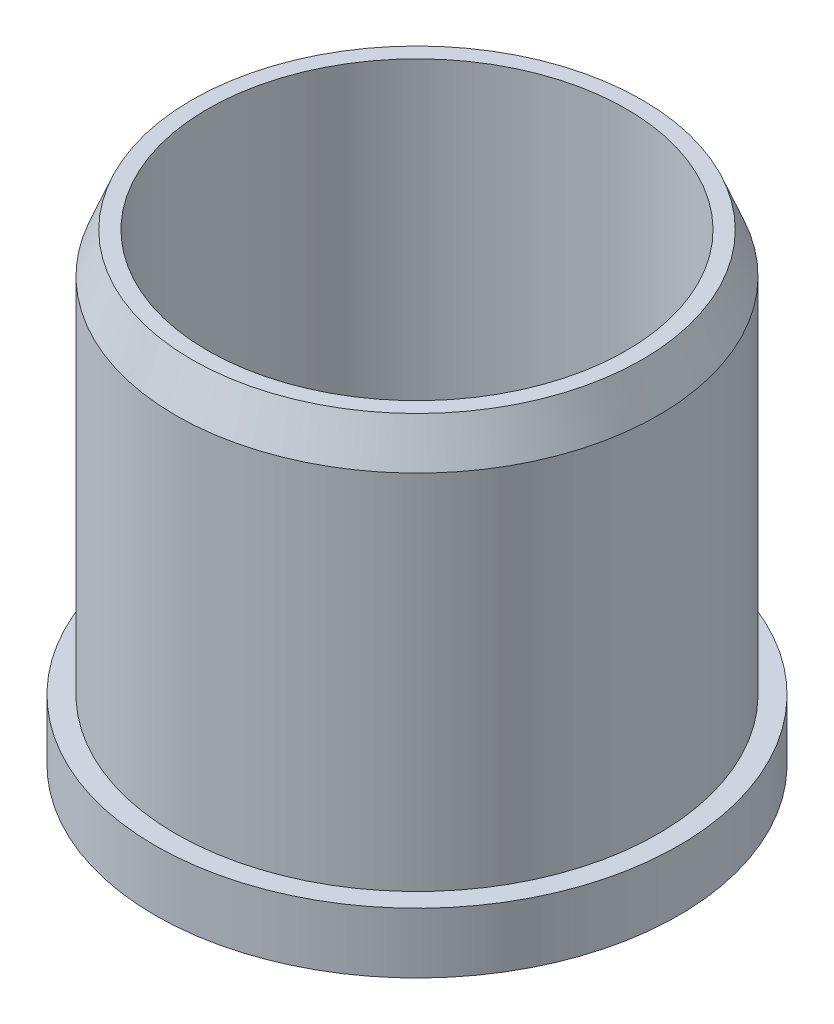
ISO-10303-21;
HEADER;
FILE_DESCRIPTION(('STEP AP214'),'2;1');
FILE_NAME('part.step','',(''),(''),'','','');
FILE_SCHEMA(('AUTOMOTIVE_DESIGN { 1 0 10303 214 1 1 1 1 }'));
ENDSEC;
DATA;
#1=APPLICATION_CONTEXT('core data for automotive mechanical design processes');
#2=APPLICATION_PROTOCOL_DEFINITION('international standard','automotive_design',2000,#1);
#3=PRODUCT_CONTEXT('',#1,'mechanical');
#4=PRODUCT('Part','Part','',(#3));
#5=PRODUCT_RELATED_PRODUCT_CATEGORY('part','',(#4));
#6=PRODUCT_DEFINITION_FORMATION('','',#4);
#7=PRODUCT_DEFINITION_CONTEXT('part definition',#1,'design');
#8=PRODUCT_DEFINITION('design','',#6,#7);
#9=PRODUCT_DEFINITION_SHAPE('','',#8);
#10=(LENGTH_UNIT() NAMED_UNIT(*) SI_UNIT(.MILLI.,.METRE.));
#11=(NAMED_UNIT(*) PLANE_ANGLE_UNIT() SI_UNIT($,.RADIAN.));
#12=(NAMED_UNIT(*) SI_UNIT($,.STERADIAN.) SOLID_ANGLE_UNIT());
#13=UNCERTAINTY_MEASURE_WITH_UNIT(LENGTH_MEASURE(1.E-05),#10,'distance_accuracy_value','');
#14=(GEOMETRIC_REPRESENTATION_CONTEXT(3) GLOBAL_UNCERTAINTY_ASSIGNED_CONTEXT((#13)) GLOBAL_UNIT_ASSIGNED_CONTEXT((#10,
#11,#12)) REPRESENTATION_CONTEXT('',''));
#15=CARTESIAN_POINT('',(0.,0.,0.));
#16=DIRECTION('',(0.,0.,1.));
#17=DIRECTION('',(1.,0.,0.));
#18=AXIS2_PLACEMENT_3D('',#15,#16,#17);
#19=CARTESIAN_POINT('',(0.,9.525,0.));
#20=DIRECTION('',(0.,1.,0.));
#21=DIRECTION('',(0.,0.,1.));
#22=AXIS2_PLACEMENT_3D('',#19,#20,#21);
#23=PLANE('',#22);
#24=CARTESIAN_POINT('',(0.,9.525,0.));
#25=DIRECTION('',(0.,1.,0.));
#26=DIRECTION('',(0.,0.,1.));
#27=AXIS2_PLACEMENT_3D('',#24,#25,#26);
#28=CIRCLE('',#27,12.7);
#29=CARTESIAN_POINT('',(0.,9.525,12.7));
#30=VERTEX_POINT('',#29);
#31=EDGE_CURVE('E87',#30,#30,#28,.T.);
#32=ORIENTED_EDGE('',*,*,#31,.F.);
#33=EDGE_LOOP('',(#32));
#34=FACE_BOUND('',#33,.T.);
#35=CARTESIAN_POINT('',(21.7411519625083,9.525,-7.06412849141284));
#36=DIRECTION('',(0.,1.,0.));
#37=DIRECTION('',(0.,0.,1.));
#38=AXIS2_PLACEMENT_3D('',#35,#36,#37);
#39=CIRCLE('',#38,7.62);
#40=CARTESIAN_POINT('',(21.7411519625083,9.525,0.555871508587157));
#41=VERTEX_POINT('',#40);
#42=EDGE_CURVE('E133',#41,#41,#39,.T.);
#43=ORIENTED_EDGE('',*,*,#42,.F.);
#44=EDGE_LOOP('',(#43));
#45=FACE_BOUND('',#44,.T.);
#46=CARTESIAN_POINT('',(13.4367708674089,9.525,18.4941284914103));
#47=DIRECTION('',(0.,1.,0.));
#48=DIRECTION('',(0.,0.,1.));
#49=AXIS2_PLACEMENT_3D('',#46,#47,#48);
#50=CIRCLE('',#49,7.62);
#51=CARTESIAN_POINT('',(13.4367708674089,9.525,26.1141284914103));
#52=VERTEX_POINT('',#51);
#53=EDGE_CURVE('E130',#52,#52,#50,.T.);
#54=ORIENTED_EDGE('',*,*,#53,.F.);
#55=EDGE_LOOP('',(#54));
#56=FACE_BOUND('',#55,.T.);
#57=CARTESIAN_POINT('',(-13.436770867403,9.525,18.4941284914123));
#58=DIRECTION('',(0.,1.,0.));
#59=DIRECTION('',(0.,0.,1.));
#60=AXIS2_PLACEMENT_3D('',#57,#58,#59);
#61=CIRCLE('',#60,7.62);
#62=CARTESIAN_POINT('',(-13.436770867403,9.525,26.1141284914122));
#63=VERTEX_POINT('',#62);
#64=EDGE_CURVE('E127',#63,#63,#61,.T.);
#65=ORIENTED_EDGE('',*,*,#64,.F.);
#66=EDGE_LOOP('',(#65));
#67=FACE_BOUND('',#66,.T.);
#68=CARTESIAN_POINT('',(-21.7411519625061,9.525,-7.06412849140975));
#69=DIRECTION('',(0.,1.,0.));
#70=DIRECTION('',(0.,0.,1.));
#71=AXIS2_PLACEMENT_3D('',#68,#69,#70);
#72=CIRCLE('',#71,7.62);
#73=CARTESIAN_POINT('',(-21.7411519625061,9.525,0.555871508590244));
#74=VERTEX_POINT('',#73);
#75=EDGE_CURVE('E123',#74,#74,#72,.T.);
#76=ORIENTED_EDGE('',*,*,#75,.F.);
#77=EDGE_LOOP('',(#76));
#78=FACE_BOUND('',#77,.T.);
#79=CARTESIAN_POINT('',(0.,9.525,-22.86));
#80=DIRECTION('',(0.,1.,0.));
#81=DIRECTION('',(0.,0.,1.));
#82=AXIS2_PLACEMENT_3D('',#79,#80,#81);
#83=CIRCLE('',#82,7.62);
#84=CARTESIAN_POINT('',(0.,9.525,-15.24));
#85=VERTEX_POINT('',#84);
#86=EDGE_CURVE('E120',#85,#85,#83,.T.);
#87=ORIENTED_EDGE('',*,*,#86,.F.);
#88=EDGE_LOOP('',(#87));
#89=FACE_BOUND('',#88,.T.);
#90=CARTESIAN_POINT('',(0.,9.525,0.));
#91=DIRECTION('',(0.,1.,0.));
#92=DIRECTION('',(0.,0.,1.));
#93=AXIS2_PLACEMENT_3D('',#90,#91,#92);
#94=CIRCLE('',#93,33.02);
#95=CARTESIAN_POINT('',(0.,9.525,33.02));
#96=VERTEX_POINT('',#95);
#97=EDGE_CURVE('E102',#96,#96,#94,.T.);
#98=ORIENTED_EDGE('',*,*,#97,.T.);
#99=EDGE_LOOP('',(#98));
#100=FACE_BOUND('',#99,.T.);
#101=ADVANCED_FACE('F41',(#34,#45,#56,#67,#78,#89,#100),#23,.T.);
#102=CARTESIAN_POINT('',(0.,9.525,0.));
#103=DIRECTION('',(0.,-1.,0.));
#104=DIRECTION('',(0.,0.,-1.));
#105=AXIS2_PLACEMENT_3D('',#102,#103,#104);
#106=CYLINDRICAL_SURFACE('',#105,7.1);
#107=CARTESIAN_POINT('',(0.,0.,0.));
#108=DIRECTION('',(0.,1.,0.));
#109=DIRECTION('',(0.,0.,1.));
#110=AXIS2_PLACEMENT_3D('',#107,#108,#109);
#111=CIRCLE('',#110,7.1);
#112=CARTESIAN_POINT('',(6.64529909033446,0.,-2.5));
#113=VERTEX_POINT('',#112);
#114=CARTESIAN_POINT('',(6.64529909033446,0.,2.5));
#115=VERTEX_POINT('',#114);
#116=EDGE_CURVE('E156',#113,#115,#111,.T.);
#117=ORIENTED_EDGE('',*,*,#116,.F.);
#118=DIRECTION('',(0.,-1.,0.));
#119=VECTOR('',#118,1.);
#120=CARTESIAN_POINT('',(6.64529909033446,9.525,-2.5));
#121=LINE('',#120,#119);
#122=CARTESIAN_POINT('',(6.64529909033446,25.4,-2.5));
#123=VERTEX_POINT('',#122);
#124=EDGE_CURVE('E119',#123,#113,#121,.T.);
#125=ORIENTED_EDGE('',*,*,#124,.F.);
#126=CARTESIAN_POINT('',(0.,25.4,0.));
#127=DIRECTION('',(0.,1.,0.));
#128=DIRECTION('',(0.,0.,1.));
#129=AXIS2_PLACEMENT_3D('',#126,#127,#128);
#130=CIRCLE('',#129,7.1);
#131=CARTESIAN_POINT('',(6.64529909033446,25.4,2.5));
#132=VERTEX_POINT('',#131);
#133=EDGE_CURVE('E86',#132,#123,#130,.F.);
#134=ORIENTED_EDGE('',*,*,#133,.F.);
#135=DIRECTION('',(0.,-1.,0.));
#136=VECTOR('',#135,1.);
#137=CARTESIAN_POINT('',(6.64529909033446,9.525,2.5));
#138=LINE('',#137,#136);
#139=EDGE_CURVE('E56',#132,#115,#138,.T.);
#140=ORIENTED_EDGE('',*,*,#139,.T.);
#141=EDGE_LOOP('',(#117,#125,#134,#140));
#142=FACE_BOUND('',#141,.T.);
#143=ADVANCED_FACE('F184',(#142),#106,.F.);
#144=CARTESIAN_POINT('',(0.,9.525,-2.5));
#145=DIRECTION('',(0.,0.,1.));
#146=DIRECTION('',(1.,0.,0.));
#147=AXIS2_PLACEMENT_3D('',#144,#145,#146);
#148=PLANE('',#147);
#149=DIRECTION('',(-1.,0.,0.));
#150=VECTOR('',#149,1.);
#151=CARTESIAN_POINT('',(0.,0.,-2.5));
#152=LINE('',#151,#150);
#153=CARTESIAN_POINT('',(9.6,0.,-2.5));
#154=VERTEX_POINT('',#153);
#155=EDGE_CURVE('E159',#154,#113,#152,.T.);
#156=ORIENTED_EDGE('',*,*,#155,.F.);
#157=DIRECTION('',(0.,-1.,0.));
#158=VECTOR('',#157,1.);
#159=CARTESIAN_POINT('',(9.6,9.525,-2.5));
#160=LINE('',#159,#158);
#161=CARTESIAN_POINT('',(9.6,25.4,-2.5));
#162=VERTEX_POINT('',#161);
#163=EDGE_CURVE('E97',#162,#154,#160,.T.);
#164=ORIENTED_EDGE('',*,*,#163,.F.);
#165=DIRECTION('',(1.,0.,0.));
#166=VECTOR('',#165,1.);
#167=CARTESIAN_POINT('',(0.,25.4,-2.5));
#168=LINE('',#167,#166);
#169=EDGE_CURVE('E101',#123,#162,#168,.T.);
#170=ORIENTED_EDGE('',*,*,#169,.F.);
#171=ORIENTED_EDGE('',*,*,#124,.T.);
#172=EDGE_LOOP('',(#156,#164,#170,#171));
#173=FACE_BOUND('',#172,.T.);
#174=ADVANCED_FACE('F191',(#173),#148,.T.);
#175=CARTESIAN_POINT('',(9.6,9.525,0.));
#176=DIRECTION('',(-1.,0.,0.));
#177=DIRECTION('',(0.,0.,1.));
#178=AXIS2_PLACEMENT_3D('',#175,#176,#177);
#179=PLANE('',#178);
#180=DIRECTION('',(0.,0.,-1.));
#181=VECTOR('',#180,1.);
#182=CARTESIAN_POINT('',(9.6,0.,0.));
#183=LINE('',#182,#181);
#184=CARTESIAN_POINT('',(9.6,0.,2.5));
#185=VERTEX_POINT('',#184);
#186=EDGE_CURVE('E96',#185,#154,#183,.T.);
#187=ORIENTED_EDGE('',*,*,#186,.F.);
#188=DIRECTION('',(0.,-1.,0.));
#189=VECTOR('',#188,1.);
#190=CARTESIAN_POINT('',(9.6,9.525,2.5));
#191=LINE('',#190,#189);
#192=CARTESIAN_POINT('',(9.6,25.4,2.5));
#193=VERTEX_POINT('',#192);
#194=EDGE_CURVE('E63',#193,#185,#191,.T.);
#195=ORIENTED_EDGE('',*,*,#194,.F.);
#196=DIRECTION('',(0.,0.,1.));
#197=VECTOR('',#196,1.);
#198=CARTESIAN_POINT('',(9.6,25.4,0.));
#199=LINE('',#198,#197);
#200=EDGE_CURVE('E93',#162,#193,#199,.T.);
#201=ORIENTED_EDGE('',*,*,#200,.F.);
#202=ORIENTED_EDGE('',*,*,#163,.T.);
#203=EDGE_LOOP('',(#187,#195,#201,#202));
#204=FACE_BOUND('',#203,.T.);
#205=ADVANCED_FACE('F92',(#204),#179,.T.);
#206=CARTESIAN_POINT('',(0.,9.525,0.));
#207=DIRECTION('',(0.,-1.,0.));
#208=DIRECTION('',(0.,0.,-1.));
#209=AXIS2_PLACEMENT_3D('',#206,#207,#208);
#210=CYLINDRICAL_SURFACE('',#209,41.275);
#211=CARTESIAN_POINT('',(0.,9.525,0.));
#212=DIRECTION('',(0.,1.,0.));
#213=DIRECTION('',(0.,0.,1.));
#214=AXIS2_PLACEMENT_3D('',#211,#212,#213);
#215=CIRCLE('',#214,41.275);
#216=CARTESIAN_POINT('',(0.,9.525,41.275));
#217=VERTEX_POINT('',#216);
#218=EDGE_CURVE('E136',#217,#217,#215,.T.);
#219=ORIENTED_EDGE('',*,*,#218,.F.);
#220=EDGE_LOOP('',(#219));
#221=FACE_BOUND('',#220,.T.);
#222=CARTESIAN_POINT('',(0.,0.,0.));
#223=DIRECTION('',(0.,1.,0.));
#224=DIRECTION('',(0.,0.,1.));
#225=AXIS2_PLACEMENT_3D('',#222,#223,#224);
#226=CIRCLE('',#225,41.275);
#227=CARTESIAN_POINT('',(0.,0.,41.275));
#228=VERTEX_POINT('',#227);
#229=EDGE_CURVE('E153',#228,#228,#226,.T.);
#230=ORIENTED_EDGE('',*,*,#229,.T.);
#231=EDGE_LOOP('',(#230));
#232=FACE_BOUND('',#231,.T.);
#233=ADVANCED_FACE('F212',(#221,#232),#210,.T.);
#234=CARTESIAN_POINT('',(21.7411519625083,9.525,-7.06412849141284));
#235=DIRECTION('',(0.,-1.,0.));
#236=DIRECTION('',(0.,0.,-1.));
#237=AXIS2_PLACEMENT_3D('',#234,#235,#236);
#238=CYLINDRICAL_SURFACE('',#237,7.62);
#239=ORIENTED_EDGE('',*,*,#42,.T.);
#240=EDGE_LOOP('',(#239));
#241=FACE_BOUND('',#240,.T.);
#242=CARTESIAN_POINT('',(21.7411519625083,0.,-7.06412849141284));
#243=DIRECTION('',(0.,1.,0.));
#244=DIRECTION('',(0.,0.,1.));
#245=AXIS2_PLACEMENT_3D('',#242,#243,#244);
#246=CIRCLE('',#245,7.62);
#247=CARTESIAN_POINT('',(21.7411519625083,0.,0.555871508587157));
#248=VERTEX_POINT('',#247);
#249=EDGE_CURVE('E150',#248,#248,#246,.T.);
#250=ORIENTED_EDGE('',*,*,#249,.F.);
#251=EDGE_LOOP('',(#250));
#252=FACE_BOUND('',#251,.T.);
#253=ADVANCED_FACE('F215',(#241,#252),#238,.F.);
#254=CARTESIAN_POINT('',(13.4367708674089,9.525,18.4941284914103));
#255=DIRECTION('',(0.,-1.,0.));
#256=DIRECTION('',(0.,0.,-1.));
#257=AXIS2_PLACEMENT_3D('',#254,#255,#256);
#258=CYLINDRICAL_SURFACE('',#257,7.62);
#259=ORIENTED_EDGE('',*,*,#53,.T.);
#260=EDGE_LOOP('',(#259));
#261=FACE_BOUND('',#260,.T.);
#262=CARTESIAN_POINT('',(13.4367708674089,0.,18.4941284914103));
#263=DIRECTION('',(0.,1.,0.));
#264=DIRECTION('',(0.,0.,1.));
#265=AXIS2_PLACEMENT_3D('',#262,#263,#264);
#266=CIRCLE('',#265,7.62);
#267=CARTESIAN_POINT('',(13.4367708674089,0.,26.1141284914103));
#268=VERTEX_POINT('',#267);
#269=EDGE_CURVE('E147',#268,#268,#266,.T.);
#270=ORIENTED_EDGE('',*,*,#269,.F.);
#271=EDGE_LOOP('',(#270));
#272=FACE_BOUND('',#271,.T.);
#273=ADVANCED_FACE('F231',(#261,#272),#258,.F.);
#274=CARTESIAN_POINT('',(-13.436770867403,9.525,18.4941284914123));
#275=DIRECTION('',(0.,-1.,0.));
#276=DIRECTION('',(0.,0.,-1.));
#277=AXIS2_PLACEMENT_3D('',#274,#275,#276);
#278=CYLINDRICAL_SURFACE('',#277,7.62);
#279=ORIENTED_EDGE('',*,*,#64,.T.);
#280=EDGE_LOOP('',(#279));
#281=FACE_BOUND('',#280,.T.);
#282=CARTESIAN_POINT('',(-13.436770867403,0.,18.4941284914123));
#283=DIRECTION('',(0.,1.,0.));
#284=DIRECTION('',(0.,0.,1.));
#285=AXIS2_PLACEMENT_3D('',#282,#283,#284);
#286=CIRCLE('',#285,7.62);
#287=CARTESIAN_POINT('',(-13.436770867403,0.,26.1141284914122));
#288=VERTEX_POINT('',#287);
#289=EDGE_CURVE('E144',#288,#288,#286,.T.);
#290=ORIENTED_EDGE('',*,*,#289,.F.);
#291=EDGE_LOOP('',(#290));
#292=FACE_BOUND('',#291,.T.);
#293=ADVANCED_FACE('F235',(#281,#292),#278,.F.);
#294=CARTESIAN_POINT('',(-21.7411519625061,9.525,-7.06412849140975));
#295=DIRECTION('',(0.,-1.,0.));
#296=DIRECTION('',(0.,0.,-1.));
#297=AXIS2_PLACEMENT_3D('',#294,#295,#296);
#298=CYLINDRICAL_SURFACE('',#297,7.62);
#299=ORIENTED_EDGE('',*,*,#75,.T.);
#300=EDGE_LOOP('',(#299));
#301=FACE_BOUND('',#300,.T.);
#302=CARTESIAN_POINT('',(-21.7411519625061,0.,-7.06412849140975));
#303=DIRECTION('',(0.,1.,0.));
#304=DIRECTION('',(0.,0.,1.));
#305=AXIS2_PLACEMENT_3D('',#302,#303,#304);
#306=CIRCLE('',#305,7.62);
#307=CARTESIAN_POINT('',(-21.7411519625061,0.,0.555871508590244));
#308=VERTEX_POINT('',#307);
#309=EDGE_CURVE('E141',#308,#308,#306,.T.);
#310=ORIENTED_EDGE('',*,*,#309,.F.);
#311=EDGE_LOOP('',(#310));
#312=FACE_BOUND('',#311,.T.);
#313=ADVANCED_FACE('F239',(#301,#312),#298,.F.);
#314=CARTESIAN_POINT('',(0.,9.525,-22.86));
#315=DIRECTION('',(0.,-1.,0.));
#316=DIRECTION('',(0.,0.,-1.));
#317=AXIS2_PLACEMENT_3D('',#314,#315,#316);
#318=CYLINDRICAL_SURFACE('',#317,7.62);
#319=ORIENTED_EDGE('',*,*,#86,.T.);
#320=EDGE_LOOP('',(#319));
#321=FACE_BOUND('',#320,.T.);
#322=CARTESIAN_POINT('',(0.,0.,-22.86));
#323=DIRECTION('',(0.,1.,0.));
#324=DIRECTION('',(0.,0.,1.));
#325=AXIS2_PLACEMENT_3D('',#322,#323,#324);
#326=CIRCLE('',#325,7.62);
#327=CARTESIAN_POINT('',(0.,0.,-15.24));
#328=VERTEX_POINT('',#327);
#329=EDGE_CURVE('E113',#328,#328,#326,.T.);
#330=ORIENTED_EDGE('',*,*,#329,.F.);
#331=EDGE_LOOP('',(#330));
#332=FACE_BOUND('',#331,.T.);
#333=ADVANCED_FACE('F206',(#321,#332),#318,.F.);
#334=CARTESIAN_POINT('',(0.,9.525,2.5));
#335=DIRECTION('',(0.,0.,1.));
#336=DIRECTION('',(1.,0.,0.));
#337=AXIS2_PLACEMENT_3D('',#334,#335,#336);
#338=PLANE('',#337);
#339=DIRECTION('',(-1.,0.,0.));
#340=VECTOR('',#339,1.);
#341=CARTESIAN_POINT('',(0.,0.,2.5));
#342=LINE('',#341,#340);
#343=EDGE_CURVE('E124',#185,#115,#342,.T.);
#344=ORIENTED_EDGE('',*,*,#343,.T.);
#345=ORIENTED_EDGE('',*,*,#139,.F.);
#346=DIRECTION('',(-1.,0.,0.));
#347=VECTOR('',#346,1.);
#348=CARTESIAN_POINT('',(0.,25.4,2.5));
#349=LINE('',#348,#347);
#350=EDGE_CURVE('E81',#193,#132,#349,.T.);
#351=ORIENTED_EDGE('',*,*,#350,.F.);
#352=ORIENTED_EDGE('',*,*,#194,.T.);
#353=EDGE_LOOP('',(#344,#345,#351,#352));
#354=FACE_BOUND('',#353,.T.);
#355=ADVANCED_FACE('F82',(#354),#338,.F.);
#356=CARTESIAN_POINT('',(0.,9.525,0.));
#357=DIRECTION('',(0.,1.,0.));
#358=DIRECTION('',(0.,0.,1.));
#359=AXIS2_PLACEMENT_3D('',#356,#357,#358);
#360=CIRCLE('',#359,38.0365);
#361=CARTESIAN_POINT('',(0.,9.525,38.0365));
#362=VERTEX_POINT('',#361);
#363=EDGE_CURVE('E115',#362,#362,#360,.T.);
#364=ORIENTED_EDGE('',*,*,#363,.F.);
#365=EDGE_LOOP('',(#364));
#366=FACE_BOUND('',#365,.T.);
#367=ORIENTED_EDGE('',*,*,#218,.T.);
#368=EDGE_LOOP('',(#367));
#369=FACE_BOUND('',#368,.T.);
#370=ADVANCED_FACE('F187',(#366,#369),#23,.T.);
#371=CARTESIAN_POINT('',(0.,0.,0.));
#372=DIRECTION('',(0.,1.,0.));
#373=DIRECTION('',(0.,0.,1.));
#374=AXIS2_PLACEMENT_3D('',#371,#372,#373);
#375=PLANE('',#374);
#376=ORIENTED_EDGE('',*,*,#329,.T.);
#377=EDGE_LOOP('',(#376));
#378=FACE_BOUND('',#377,.T.);
#379=ORIENTED_EDGE('',*,*,#309,.T.);
#380=EDGE_LOOP('',(#379));
#381=FACE_BOUND('',#380,.T.);
#382=ORIENTED_EDGE('',*,*,#289,.T.);
#383=EDGE_LOOP('',(#382));
#384=FACE_BOUND('',#383,.T.);
#385=ORIENTED_EDGE('',*,*,#269,.T.);
#386=EDGE_LOOP('',(#385));
#387=FACE_BOUND('',#386,.T.);
#388=ORIENTED_EDGE('',*,*,#249,.T.);
#389=EDGE_LOOP('',(#388));
#390=FACE_BOUND('',#389,.T.);
#391=ORIENTED_EDGE('',*,*,#229,.F.);
#392=EDGE_LOOP('',(#391));
#393=FACE_BOUND('',#392,.T.);
#394=ORIENTED_EDGE('',*,*,#116,.T.);
#395=ORIENTED_EDGE('',*,*,#343,.F.);
#396=ORIENTED_EDGE('',*,*,#186,.T.);
#397=ORIENTED_EDGE('',*,*,#155,.T.);
#398=EDGE_LOOP('',(#394,#395,#396,#397));
#399=FACE_BOUND('',#398,.T.);
#400=ADVANCED_FACE('F198',(#378,#381,#384,#387,#390,#393,#399),#375,.F.);
#401=CARTESIAN_POINT('',(0.,73.025,0.));
#402=DIRECTION('',(0.,1.,0.));
#403=DIRECTION('',(0.,0.,1.));
#404=AXIS2_PLACEMENT_3D('',#401,#402,#403);
#405=PLANE('',#404);
#406=CARTESIAN_POINT('',(0.,73.025,0.));
#407=DIRECTION('',(0.,1.,0.));
#408=DIRECTION('',(0.,0.,1.));
#409=AXIS2_PLACEMENT_3D('',#406,#407,#408);
#410=CIRCLE('',#409,35.4965);
#411=CARTESIAN_POINT('',(0.,73.025,35.4965));
#412=VERTEX_POINT('',#411);
#413=EDGE_CURVE('E118',#412,#412,#410,.T.);
#414=ORIENTED_EDGE('',*,*,#413,.T.);
#415=EDGE_LOOP('',(#414));
#416=FACE_BOUND('',#415,.T.);
#417=CARTESIAN_POINT('',(0.,73.025,0.));
#418=DIRECTION('',(0.,1.,0.));
#419=DIRECTION('',(0.,0.,1.));
#420=AXIS2_PLACEMENT_3D('',#417,#418,#419);
#421=CIRCLE('',#420,33.02);
#422=CARTESIAN_POINT('',(0.,73.025,33.02));
#423=VERTEX_POINT('',#422);
#424=EDGE_CURVE('E105',#423,#423,#421,.T.);
#425=ORIENTED_EDGE('',*,*,#424,.F.);
#426=EDGE_LOOP('',(#425));
#427=FACE_BOUND('',#426,.T.);
#428=ADVANCED_FACE('F204',(#416,#427),#405,.T.);
#429=CARTESIAN_POINT('',(0.,73.025,0.));
#430=DIRECTION('',(0.,-1.,0.));
#431=DIRECTION('',(0.,0.,-1.));
#432=AXIS2_PLACEMENT_3D('',#429,#430,#431);
#433=CYLINDRICAL_SURFACE('',#432,38.0365);
#434=CARTESIAN_POINT('',(0.,66.675,0.));
#435=DIRECTION('',(0.,1.,0.));
#436=DIRECTION('',(0.,0.,1.));
#437=AXIS2_PLACEMENT_3D('',#434,#435,#436);
#438=CIRCLE('',#437,38.0365);
#439=CARTESIAN_POINT('',(0.,66.675,38.0365));
#440=VERTEX_POINT('',#439);
#441=EDGE_CURVE('E169',#440,#440,#438,.F.);
#442=ORIENTED_EDGE('',*,*,#441,.T.);
#443=EDGE_LOOP('',(#442));
#444=FACE_BOUND('',#443,.T.);
#445=ORIENTED_EDGE('',*,*,#363,.T.);
#446=EDGE_LOOP('',(#445));
#447=FACE_BOUND('',#446,.T.);
#448=ADVANCED_FACE('F267',(#444,#447),#433,.T.);
#449=CARTESIAN_POINT('',(0.,73.025,0.));
#450=DIRECTION('',(0.,-1.,0.));
#451=DIRECTION('',(0.,0.,-1.));
#452=AXIS2_PLACEMENT_3D('',#449,#450,#451);
#453=CYLINDRICAL_SURFACE('',#452,33.02);
#454=ORIENTED_EDGE('',*,*,#424,.T.);
#455=EDGE_LOOP('',(#454));
#456=FACE_BOUND('',#455,.T.);
#457=ORIENTED_EDGE('',*,*,#97,.F.);
#458=EDGE_LOOP('',(#457));
#459=FACE_BOUND('',#458,.T.);
#460=ADVANCED_FACE('F258',(#456,#459),#453,.F.);
#461=CARTESIAN_POINT('',(0.,25.4,0.));
#462=DIRECTION('',(0.,-1.,0.));
#463=DIRECTION('',(0.,0.,-1.));
#464=AXIS2_PLACEMENT_3D('',#461,#462,#463);
#465=CYLINDRICAL_SURFACE('',#464,12.7);
#466=CARTESIAN_POINT('',(0.,29.21,0.));
#467=DIRECTION('',(0.,1.,0.));
#468=DIRECTION('',(0.,0.,1.));
#469=AXIS2_PLACEMENT_3D('',#466,#467,#468);
#470=CIRCLE('',#469,12.7);
#471=CARTESIAN_POINT('',(0.,29.21,12.7));
#472=VERTEX_POINT('',#471);
#473=EDGE_CURVE('E11',#472,#472,#470,.F.);
#474=ORIENTED_EDGE('',*,*,#473,.T.);
#475=EDGE_LOOP('',(#474));
#476=FACE_BOUND('',#475,.T.);
#477=ORIENTED_EDGE('',*,*,#31,.T.);
#478=EDGE_LOOP('',(#477));
#479=FACE_BOUND('',#478,.T.);
#480=ADVANCED_FACE('F251',(#476,#479),#465,.T.);
#481=CARTESIAN_POINT('',(0.,73.025,0.));
#482=DIRECTION('',(0.,-1.,0.));
#483=DIRECTION('',(0.,0.,-1.));
#484=AXIS2_PLACEMENT_3D('',#481,#482,#483);
#485=CONICAL_SURFACE('',#484,35.4965,0.380506377112362);
#486=ORIENTED_EDGE('',*,*,#441,.F.);
#487=EDGE_LOOP('',(#486));
#488=FACE_BOUND('',#487,.T.);
#489=ORIENTED_EDGE('',*,*,#413,.F.);
#490=EDGE_LOOP('',(#489));
#491=FACE_BOUND('',#490,.T.);
#492=ADVANCED_FACE('F247',(#488,#491),#485,.T.);
#493=CARTESIAN_POINT('',(0.,25.4,0.));
#494=DIRECTION('',(0.,1.,0.));
#495=DIRECTION('',(0.,0.,1.));
#496=AXIS2_PLACEMENT_3D('',#493,#494,#495);
#497=PLANE('',#496);
#498=ORIENTED_EDGE('',*,*,#200,.T.);
#499=ORIENTED_EDGE('',*,*,#350,.T.);
#500=ORIENTED_EDGE('',*,*,#133,.T.);
#501=ORIENTED_EDGE('',*,*,#169,.T.);
#502=EDGE_LOOP('',(#498,#499,#500,#501));
#503=FACE_BOUND('',#502,.T.);
#504=ADVANCED_FACE('F99',(#503),#497,.F.);
#505=CARTESIAN_POINT('',(0.,31.75,0.));
#506=DIRECTION('',(0.,1.,0.));
#507=DIRECTION('',(0.,0.,1.));
#508=AXIS2_PLACEMENT_3D('',#505,#506,#507);
#509=PLANE('',#508);
#510=CARTESIAN_POINT('',(0.,31.75,0.));
#511=DIRECTION('',(0.,1.,0.));
#512=DIRECTION('',(0.,0.,1.));
#513=AXIS2_PLACEMENT_3D('',#510,#511,#512);
#514=CIRCLE('',#513,10.16);
#515=CARTESIAN_POINT('',(0.,31.75,10.16));
#516=VERTEX_POINT('',#515);
#517=EDGE_CURVE('E49',#516,#516,#514,.T.);
#518=ORIENTED_EDGE('',*,*,#517,.T.);
#519=EDGE_LOOP('',(#518));
#520=FACE_BOUND('',#519,.T.);
#521=ADVANCED_FACE('F174',(#520),#509,.T.);
#522=CARTESIAN_POINT('',(0.,29.21,0.));
#523=DIRECTION('',(0.,1.,0.));
#524=DIRECTION('',(0.,0.,1.));
#525=AXIS2_PLACEMENT_3D('',#522,#523,#524);
#526=TOROIDAL_SURFACE('',#525,10.16,2.54);
#527=ORIENTED_EDGE('',*,*,#473,.F.);
#528=EDGE_LOOP('',(#527));
#529=FACE_BOUND('',#528,.T.);
#530=ORIENTED_EDGE('',*,*,#517,.F.);
#531=EDGE_LOOP('',(#530));
#532=FACE_BOUND('',#531,.T.);
#533=ADVANCED_FACE('F43',(#529,#532),#526,.T.);
#534=CLOSED_SHELL('',(#101,#143,#174,#205,#233,#253,#273,#293,#313,#333,#355,#370,#400,#428,
#448,#460,#480,#492,#504,#521,#533));
#535=MANIFOLD_SOLID_BREP('B2',#534);
#536=ADVANCED_BREP_SHAPE_REPRESENTATION('',(#18,#535),#14);
#537=SHAPE_DEFINITION_REPRESENTATION(#9,#536);
ENDSEC;
END-ISO-10303-21;
